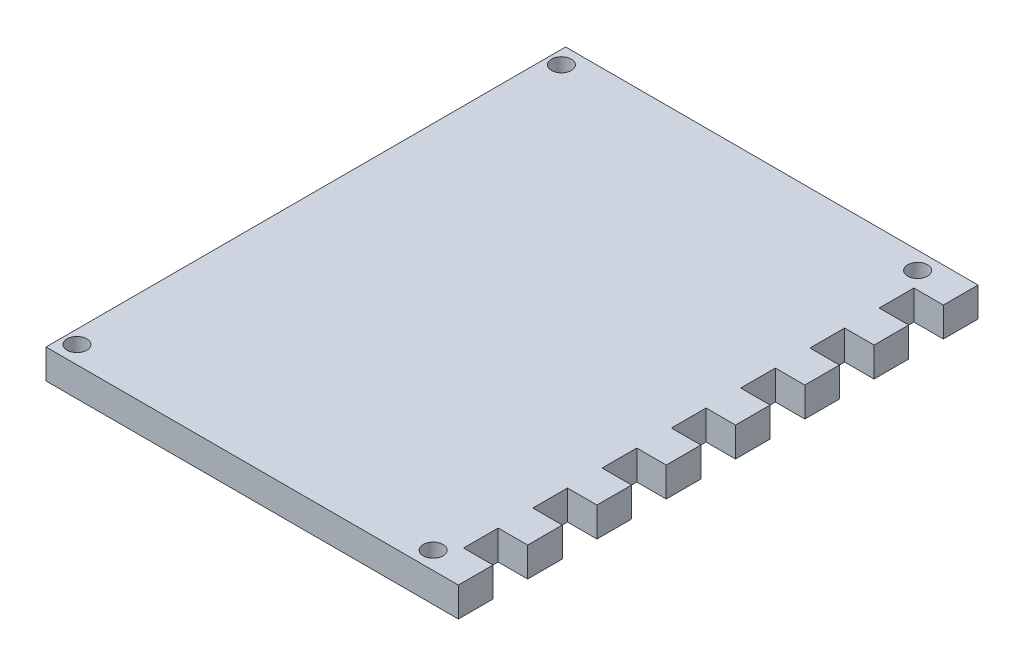
ISO-10303-21;
HEADER;
FILE_DESCRIPTION(('STEP AP214'),'2;1');
FILE_NAME('part.step','',(''),(''),'','','');
FILE_SCHEMA(('AUTOMOTIVE_DESIGN { 1 0 10303 214 1 1 1 1 }'));
ENDSEC;
DATA;
#1=APPLICATION_CONTEXT('core data for automotive mechanical design processes');
#2=APPLICATION_PROTOCOL_DEFINITION('international standard','automotive_design',2000,#1);
#3=PRODUCT_CONTEXT('',#1,'mechanical');
#4=PRODUCT('Part','Part','',(#3));
#5=PRODUCT_RELATED_PRODUCT_CATEGORY('part','',(#4));
#6=PRODUCT_DEFINITION_FORMATION('','',#4);
#7=PRODUCT_DEFINITION_CONTEXT('part definition',#1,'design');
#8=PRODUCT_DEFINITION('design','',#6,#7);
#9=PRODUCT_DEFINITION_SHAPE('','',#8);
#10=(LENGTH_UNIT() NAMED_UNIT(*) SI_UNIT(.MILLI.,.METRE.));
#11=(NAMED_UNIT(*) PLANE_ANGLE_UNIT() SI_UNIT($,.RADIAN.));
#12=(NAMED_UNIT(*) SI_UNIT($,.STERADIAN.) SOLID_ANGLE_UNIT());
#13=UNCERTAINTY_MEASURE_WITH_UNIT(LENGTH_MEASURE(1.E-05),#10,'distance_accuracy_value','');
#14=(GEOMETRIC_REPRESENTATION_CONTEXT(3) GLOBAL_UNCERTAINTY_ASSIGNED_CONTEXT((#13)) GLOBAL_UNIT_ASSIGNED_CONTEXT((#10,
#11,#12)) REPRESENTATION_CONTEXT('',''));
#15=CARTESIAN_POINT('',(0.,0.,0.));
#16=DIRECTION('',(0.,0.,1.));
#17=DIRECTION('',(1.,0.,0.));
#18=AXIS2_PLACEMENT_3D('',#15,#16,#17);
#19=CARTESIAN_POINT('',(0.,4.7625,0.));
#20=DIRECTION('',(0.,-1.,0.));
#21=DIRECTION('',(0.,0.,-1.));
#22=AXIS2_PLACEMENT_3D('',#19,#20,#21);
#23=PLANE('',#22);
#24=DIRECTION('',(0.,0.,1.));
#25=VECTOR('',#24,1.);
#26=CARTESIAN_POINT('',(0.,4.7625,0.));
#27=LINE('',#26,#25);
#28=CARTESIAN_POINT('',(0.,4.7625,-84.));
#29=VERTEX_POINT('',#28);
#30=CARTESIAN_POINT('',(0.,4.7625,0.));
#31=VERTEX_POINT('',#30);
#32=EDGE_CURVE('E382',#29,#31,#27,.T.);
#33=ORIENTED_EDGE('',*,*,#32,.T.);
#34=DIRECTION('',(1.,0.,0.));
#35=VECTOR('',#34,1.);
#36=CARTESIAN_POINT('',(0.,4.7625,0.));
#37=LINE('',#36,#35);
#38=CARTESIAN_POINT('',(66.6625,4.7625,0.));
#39=VERTEX_POINT('',#38);
#40=EDGE_CURVE('E170',#31,#39,#37,.T.);
#41=ORIENTED_EDGE('',*,*,#40,.T.);
#42=DIRECTION('',(0.,0.,-1.));
#43=VECTOR('',#42,1.);
#44=CARTESIAN_POINT('',(66.6625,4.7625,-5.6));
#45=LINE('',#44,#43);
#46=CARTESIAN_POINT('',(66.6625,4.7625,-5.6));
#47=VERTEX_POINT('',#46);
#48=EDGE_CURVE('E499',#39,#47,#45,.T.);
#49=ORIENTED_EDGE('',*,*,#48,.T.);
#50=DIRECTION('',(-1.,0.,0.));
#51=VECTOR('',#50,1.);
#52=CARTESIAN_POINT('',(61.9,4.7625,-5.6));
#53=LINE('',#52,#51);
#54=CARTESIAN_POINT('',(61.9,4.7625,-5.6));
#55=VERTEX_POINT('',#54);
#56=EDGE_CURVE('E517',#47,#55,#53,.T.);
#57=ORIENTED_EDGE('',*,*,#56,.T.);
#58=DIRECTION('',(0.,0.,-1.));
#59=VECTOR('',#58,1.);
#60=CARTESIAN_POINT('',(61.9,4.7625,-11.2));
#61=LINE('',#60,#59);
#62=CARTESIAN_POINT('',(61.9,4.7625,-11.2));
#63=VERTEX_POINT('',#62);
#64=EDGE_CURVE('E513',#55,#63,#61,.T.);
#65=ORIENTED_EDGE('',*,*,#64,.T.);
#66=DIRECTION('',(1.,0.,0.));
#67=VECTOR('',#66,1.);
#68=CARTESIAN_POINT('',(66.6625,4.7625,-11.2));
#69=LINE('',#68,#67);
#70=CARTESIAN_POINT('',(66.6625,4.7625,-11.2));
#71=VERTEX_POINT('',#70);
#72=EDGE_CURVE('E516',#63,#71,#69,.T.);
#73=ORIENTED_EDGE('',*,*,#72,.T.);
#74=DIRECTION('',(0.,0.,-1.));
#75=VECTOR('',#74,1.);
#76=CARTESIAN_POINT('',(66.6625,4.7625,-16.8));
#77=LINE('',#76,#75);
#78=CARTESIAN_POINT('',(66.6625,4.7625,-16.8));
#79=VERTEX_POINT('',#78);
#80=EDGE_CURVE('E521',#71,#79,#77,.T.);
#81=ORIENTED_EDGE('',*,*,#80,.T.);
#82=DIRECTION('',(-1.,0.,0.));
#83=VECTOR('',#82,1.);
#84=CARTESIAN_POINT('',(61.9,4.7625,-16.8));
#85=LINE('',#84,#83);
#86=CARTESIAN_POINT('',(61.9,4.7625,-16.8));
#87=VERTEX_POINT('',#86);
#88=EDGE_CURVE('E528',#79,#87,#85,.T.);
#89=ORIENTED_EDGE('',*,*,#88,.T.);
#90=DIRECTION('',(0.,0.,-1.));
#91=VECTOR('',#90,1.);
#92=CARTESIAN_POINT('',(61.9,4.7625,-22.4));
#93=LINE('',#92,#91);
#94=CARTESIAN_POINT('',(61.9,4.7625,-22.4));
#95=VERTEX_POINT('',#94);
#96=EDGE_CURVE('E531',#87,#95,#93,.T.);
#97=ORIENTED_EDGE('',*,*,#96,.T.);
#98=DIRECTION('',(1.,0.,0.));
#99=VECTOR('',#98,1.);
#100=CARTESIAN_POINT('',(66.6625,4.7625,-22.4));
#101=LINE('',#100,#99);
#102=CARTESIAN_POINT('',(66.6625,4.7625,-22.4));
#103=VERTEX_POINT('',#102);
#104=EDGE_CURVE('E534',#95,#103,#101,.T.);
#105=ORIENTED_EDGE('',*,*,#104,.T.);
#106=DIRECTION('',(0.,0.,-1.));
#107=VECTOR('',#106,1.);
#108=CARTESIAN_POINT('',(66.6625,4.7625,-28.));
#109=LINE('',#108,#107);
#110=CARTESIAN_POINT('',(66.6625,4.7625,-28.));
#111=VERTEX_POINT('',#110);
#112=EDGE_CURVE('E537',#103,#111,#109,.T.);
#113=ORIENTED_EDGE('',*,*,#112,.T.);
#114=DIRECTION('',(-1.,0.,0.));
#115=VECTOR('',#114,1.);
#116=CARTESIAN_POINT('',(61.9,4.7625,-28.));
#117=LINE('',#116,#115);
#118=CARTESIAN_POINT('',(61.9,4.7625,-28.));
#119=VERTEX_POINT('',#118);
#120=EDGE_CURVE('E540',#111,#119,#117,.T.);
#121=ORIENTED_EDGE('',*,*,#120,.T.);
#122=DIRECTION('',(0.,0.,-1.));
#123=VECTOR('',#122,1.);
#124=CARTESIAN_POINT('',(61.9,4.7625,-33.6));
#125=LINE('',#124,#123);
#126=CARTESIAN_POINT('',(61.9,4.7625,-33.6));
#127=VERTEX_POINT('',#126);
#128=EDGE_CURVE('E543',#119,#127,#125,.T.);
#129=ORIENTED_EDGE('',*,*,#128,.T.);
#130=DIRECTION('',(1.,0.,0.));
#131=VECTOR('',#130,1.);
#132=CARTESIAN_POINT('',(66.6625,4.7625,-33.6));
#133=LINE('',#132,#131);
#134=CARTESIAN_POINT('',(66.6625,4.7625,-33.6));
#135=VERTEX_POINT('',#134);
#136=EDGE_CURVE('E546',#127,#135,#133,.T.);
#137=ORIENTED_EDGE('',*,*,#136,.T.);
#138=DIRECTION('',(0.,0.,-1.));
#139=VECTOR('',#138,1.);
#140=CARTESIAN_POINT('',(66.6625,4.7625,-39.2));
#141=LINE('',#140,#139);
#142=CARTESIAN_POINT('',(66.6625,4.7625,-39.2));
#143=VERTEX_POINT('',#142);
#144=EDGE_CURVE('E549',#135,#143,#141,.T.);
#145=ORIENTED_EDGE('',*,*,#144,.T.);
#146=DIRECTION('',(-1.,0.,0.));
#147=VECTOR('',#146,1.);
#148=CARTESIAN_POINT('',(61.9,4.7625,-39.2));
#149=LINE('',#148,#147);
#150=CARTESIAN_POINT('',(61.9,4.7625,-39.2));
#151=VERTEX_POINT('',#150);
#152=EDGE_CURVE('E552',#143,#151,#149,.T.);
#153=ORIENTED_EDGE('',*,*,#152,.T.);
#154=DIRECTION('',(0.,0.,-1.));
#155=VECTOR('',#154,1.);
#156=CARTESIAN_POINT('',(61.9,4.7625,-44.8));
#157=LINE('',#156,#155);
#158=CARTESIAN_POINT('',(61.9,4.7625,-44.8));
#159=VERTEX_POINT('',#158);
#160=EDGE_CURVE('E555',#151,#159,#157,.T.);
#161=ORIENTED_EDGE('',*,*,#160,.T.);
#162=DIRECTION('',(1.,0.,0.));
#163=VECTOR('',#162,1.);
#164=CARTESIAN_POINT('',(66.6625,4.7625,-44.8));
#165=LINE('',#164,#163);
#166=CARTESIAN_POINT('',(66.6625,4.7625,-44.8));
#167=VERTEX_POINT('',#166);
#168=EDGE_CURVE('E558',#159,#167,#165,.T.);
#169=ORIENTED_EDGE('',*,*,#168,.T.);
#170=DIRECTION('',(0.,0.,-1.));
#171=VECTOR('',#170,1.);
#172=CARTESIAN_POINT('',(66.6625,4.7625,-50.4));
#173=LINE('',#172,#171);
#174=CARTESIAN_POINT('',(66.6625,4.7625,-50.4));
#175=VERTEX_POINT('',#174);
#176=EDGE_CURVE('E561',#167,#175,#173,.T.);
#177=ORIENTED_EDGE('',*,*,#176,.T.);
#178=DIRECTION('',(-1.,0.,0.));
#179=VECTOR('',#178,1.);
#180=CARTESIAN_POINT('',(61.9,4.7625,-50.4));
#181=LINE('',#180,#179);
#182=CARTESIAN_POINT('',(61.9,4.7625,-50.4));
#183=VERTEX_POINT('',#182);
#184=EDGE_CURVE('E564',#175,#183,#181,.T.);
#185=ORIENTED_EDGE('',*,*,#184,.T.);
#186=DIRECTION('',(0.,0.,-1.));
#187=VECTOR('',#186,1.);
#188=CARTESIAN_POINT('',(61.9,4.7625,-56.));
#189=LINE('',#188,#187);
#190=CARTESIAN_POINT('',(61.9,4.7625,-56.));
#191=VERTEX_POINT('',#190);
#192=EDGE_CURVE('E567',#183,#191,#189,.T.);
#193=ORIENTED_EDGE('',*,*,#192,.T.);
#194=DIRECTION('',(1.,0.,0.));
#195=VECTOR('',#194,1.);
#196=CARTESIAN_POINT('',(66.6625,4.7625,-56.));
#197=LINE('',#196,#195);
#198=CARTESIAN_POINT('',(66.6625,4.7625,-56.));
#199=VERTEX_POINT('',#198);
#200=EDGE_CURVE('E570',#191,#199,#197,.T.);
#201=ORIENTED_EDGE('',*,*,#200,.T.);
#202=DIRECTION('',(0.,0.,-1.));
#203=VECTOR('',#202,1.);
#204=CARTESIAN_POINT('',(66.6625,4.7625,-61.6));
#205=LINE('',#204,#203);
#206=CARTESIAN_POINT('',(66.6625,4.7625,-61.6));
#207=VERTEX_POINT('',#206);
#208=EDGE_CURVE('E573',#199,#207,#205,.T.);
#209=ORIENTED_EDGE('',*,*,#208,.T.);
#210=DIRECTION('',(-1.,0.,0.));
#211=VECTOR('',#210,1.);
#212=CARTESIAN_POINT('',(61.9,4.7625,-61.6));
#213=LINE('',#212,#211);
#214=CARTESIAN_POINT('',(61.9,4.7625,-61.6));
#215=VERTEX_POINT('',#214);
#216=EDGE_CURVE('E576',#207,#215,#213,.T.);
#217=ORIENTED_EDGE('',*,*,#216,.T.);
#218=DIRECTION('',(0.,0.,-1.));
#219=VECTOR('',#218,1.);
#220=CARTESIAN_POINT('',(61.9,4.7625,-67.2));
#221=LINE('',#220,#219);
#222=CARTESIAN_POINT('',(61.9,4.7625,-67.2));
#223=VERTEX_POINT('',#222);
#224=EDGE_CURVE('E579',#215,#223,#221,.T.);
#225=ORIENTED_EDGE('',*,*,#224,.T.);
#226=DIRECTION('',(1.,0.,0.));
#227=VECTOR('',#226,1.);
#228=CARTESIAN_POINT('',(66.6625,4.7625,-67.1999999999999));
#229=LINE('',#228,#227);
#230=CARTESIAN_POINT('',(66.6625,4.7625,-67.1999999999999));
#231=VERTEX_POINT('',#230);
#232=EDGE_CURVE('E582',#223,#231,#229,.T.);
#233=ORIENTED_EDGE('',*,*,#232,.T.);
#234=DIRECTION('',(0.,0.,-1.));
#235=VECTOR('',#234,1.);
#236=CARTESIAN_POINT('',(66.6625,4.7625,-72.7999999999999));
#237=LINE('',#236,#235);
#238=CARTESIAN_POINT('',(66.6625,4.7625,-72.7999999999999));
#239=VERTEX_POINT('',#238);
#240=EDGE_CURVE('E585',#231,#239,#237,.T.);
#241=ORIENTED_EDGE('',*,*,#240,.T.);
#242=DIRECTION('',(-1.,0.,0.));
#243=VECTOR('',#242,1.);
#244=CARTESIAN_POINT('',(61.9,4.7625,-72.8));
#245=LINE('',#244,#243);
#246=CARTESIAN_POINT('',(61.9,4.7625,-72.8));
#247=VERTEX_POINT('',#246);
#248=EDGE_CURVE('E588',#239,#247,#245,.T.);
#249=ORIENTED_EDGE('',*,*,#248,.T.);
#250=DIRECTION('',(0.,0.,-1.));
#251=VECTOR('',#250,1.);
#252=CARTESIAN_POINT('',(61.9,4.7625,-78.4));
#253=LINE('',#252,#251);
#254=CARTESIAN_POINT('',(61.9,4.7625,-78.4));
#255=VERTEX_POINT('',#254);
#256=EDGE_CURVE('E262',#247,#255,#253,.T.);
#257=ORIENTED_EDGE('',*,*,#256,.T.);
#258=DIRECTION('',(1.,0.,0.));
#259=VECTOR('',#258,1.);
#260=CARTESIAN_POINT('',(66.6625,4.7625,-78.3999999999999));
#261=LINE('',#260,#259);
#262=CARTESIAN_POINT('',(66.6625,4.7625,-78.3999999999999));
#263=VERTEX_POINT('',#262);
#264=EDGE_CURVE('E255',#255,#263,#261,.T.);
#265=ORIENTED_EDGE('',*,*,#264,.T.);
#266=DIRECTION('',(0.,0.,-1.));
#267=VECTOR('',#266,1.);
#268=CARTESIAN_POINT('',(66.6625,4.7625,-84.));
#269=LINE('',#268,#267);
#270=CARTESIAN_POINT('',(66.6625,4.7625,-84.));
#271=VERTEX_POINT('',#270);
#272=EDGE_CURVE('E259',#263,#271,#269,.T.);
#273=ORIENTED_EDGE('',*,*,#272,.T.);
#274=DIRECTION('',(-1.,0.,0.));
#275=VECTOR('',#274,1.);
#276=CARTESIAN_POINT('',(61.9,4.7625,-84.));
#277=LINE('',#276,#275);
#278=EDGE_CURVE('E57',#271,#29,#277,.T.);
#279=ORIENTED_EDGE('',*,*,#278,.T.);
#280=EDGE_LOOP('',(#33,#41,#49,#57,#65,#73,#81,#89,#97,#105,#113,#121,#129,#137,#145,#153,#161,
#169,#177,#185,#193,#201,#209,#217,#225,#233,#241,#249,#257,#265,#273,#279));
#281=FACE_BOUND('',#280,.T.);
#282=CARTESIAN_POINT('',(2.16,4.7625,-81.16));
#283=DIRECTION('',(0.,1.,0.));
#284=DIRECTION('',(0.,0.,1.));
#285=AXIS2_PLACEMENT_3D('',#282,#283,#284);
#286=CIRCLE('',#285,1.6);
#287=CARTESIAN_POINT('',(2.16,4.7625,-79.56));
#288=VERTEX_POINT('',#287);
#289=EDGE_CURVE('E291',#288,#288,#286,.T.);
#290=ORIENTED_EDGE('',*,*,#289,.F.);
#291=EDGE_LOOP('',(#290));
#292=FACE_BOUND('',#291,.T.);
#293=CARTESIAN_POINT('',(2.15999999999999,4.7625,-2.84));
#294=DIRECTION('',(0.,1.,0.));
#295=DIRECTION('',(0.,0.,-1.));
#296=AXIS2_PLACEMENT_3D('',#293,#294,#295);
#297=CIRCLE('',#296,1.6);
#298=CARTESIAN_POINT('',(2.15999999999999,4.7625,-4.44));
#299=VERTEX_POINT('',#298);
#300=EDGE_CURVE('E615',#299,#299,#297,.T.);
#301=ORIENTED_EDGE('',*,*,#300,.F.);
#302=EDGE_LOOP('',(#301));
#303=FACE_BOUND('',#302,.T.);
#304=CARTESIAN_POINT('',(59.74,4.7625,-2.84));
#305=DIRECTION('',(0.,1.,0.));
#306=DIRECTION('',(0.,0.,1.));
#307=AXIS2_PLACEMENT_3D('',#304,#305,#306);
#308=CIRCLE('',#307,1.6);
#309=CARTESIAN_POINT('',(59.74,4.7625,-1.24));
#310=VERTEX_POINT('',#309);
#311=EDGE_CURVE('E623',#310,#310,#308,.T.);
#312=ORIENTED_EDGE('',*,*,#311,.F.);
#313=EDGE_LOOP('',(#312));
#314=FACE_BOUND('',#313,.T.);
#315=CARTESIAN_POINT('',(59.74,4.7625,-81.16));
#316=DIRECTION('',(0.,1.,0.));
#317=DIRECTION('',(0.,0.,-1.));
#318=AXIS2_PLACEMENT_3D('',#315,#316,#317);
#319=CIRCLE('',#318,1.60000000000001);
#320=CARTESIAN_POINT('',(59.74,4.7625,-82.76));
#321=VERTEX_POINT('',#320);
#322=EDGE_CURVE('E631',#321,#321,#319,.T.);
#323=ORIENTED_EDGE('',*,*,#322,.F.);
#324=EDGE_LOOP('',(#323));
#325=FACE_BOUND('',#324,.T.);
#326=ADVANCED_FACE('F39',(#281,#292,#303,#314,#325),#23,.F.);
#327=CARTESIAN_POINT('',(0.,0.,0.));
#328=DIRECTION('',(0.,-1.,0.));
#329=DIRECTION('',(0.,0.,-1.));
#330=AXIS2_PLACEMENT_3D('',#327,#328,#329);
#331=PLANE('',#330);
#332=CARTESIAN_POINT('',(59.74,0.,-2.84));
#333=DIRECTION('',(0.,1.,0.));
#334=DIRECTION('',(0.,0.,1.));
#335=AXIS2_PLACEMENT_3D('',#332,#333,#334);
#336=CIRCLE('',#335,1.6);
#337=CARTESIAN_POINT('',(59.74,0.,-1.24));
#338=VERTEX_POINT('',#337);
#339=EDGE_CURVE('E627',#338,#338,#336,.T.);
#340=ORIENTED_EDGE('',*,*,#339,.T.);
#341=EDGE_LOOP('',(#340));
#342=FACE_BOUND('',#341,.T.);
#343=CARTESIAN_POINT('',(2.16,0.,-81.16));
#344=DIRECTION('',(0.,1.,0.));
#345=DIRECTION('',(0.,0.,1.));
#346=AXIS2_PLACEMENT_3D('',#343,#344,#345);
#347=CIRCLE('',#346,1.6);
#348=CARTESIAN_POINT('',(2.16,0.,-79.56));
#349=VERTEX_POINT('',#348);
#350=EDGE_CURVE('E610',#349,#349,#347,.T.);
#351=ORIENTED_EDGE('',*,*,#350,.T.);
#352=EDGE_LOOP('',(#351));
#353=FACE_BOUND('',#352,.T.);
#354=DIRECTION('',(0.,0.,1.));
#355=VECTOR('',#354,1.);
#356=CARTESIAN_POINT('',(0.,0.,0.));
#357=LINE('',#356,#355);
#358=CARTESIAN_POINT('',(0.,0.,-84.));
#359=VERTEX_POINT('',#358);
#360=CARTESIAN_POINT('',(0.,0.,0.));
#361=VERTEX_POINT('',#360);
#362=EDGE_CURVE('E286',#359,#361,#357,.T.);
#363=ORIENTED_EDGE('',*,*,#362,.F.);
#364=DIRECTION('',(-1.,0.,0.));
#365=VECTOR('',#364,1.);
#366=CARTESIAN_POINT('',(0.,0.,-84.));
#367=LINE('',#366,#365);
#368=CARTESIAN_POINT('',(66.6625,0.,-84.));
#369=VERTEX_POINT('',#368);
#370=EDGE_CURVE('E158',#369,#359,#367,.T.);
#371=ORIENTED_EDGE('',*,*,#370,.F.);
#372=DIRECTION('',(0.,0.,-1.));
#373=VECTOR('',#372,1.);
#374=CARTESIAN_POINT('',(66.6625,0.,-84.));
#375=LINE('',#374,#373);
#376=CARTESIAN_POINT('',(66.6625,0.,-78.3999999999999));
#377=VERTEX_POINT('',#376);
#378=EDGE_CURVE('E377',#377,#369,#375,.T.);
#379=ORIENTED_EDGE('',*,*,#378,.F.);
#380=DIRECTION('',(1.,0.,0.));
#381=VECTOR('',#380,1.);
#382=CARTESIAN_POINT('',(66.6625,0.,-78.3999999999999));
#383=LINE('',#382,#381);
#384=CARTESIAN_POINT('',(61.9,0.,-78.4));
#385=VERTEX_POINT('',#384);
#386=EDGE_CURVE('E272',#385,#377,#383,.T.);
#387=ORIENTED_EDGE('',*,*,#386,.F.);
#388=DIRECTION('',(0.,0.,-1.));
#389=VECTOR('',#388,1.);
#390=CARTESIAN_POINT('',(61.9,0.,-78.4));
#391=LINE('',#390,#389);
#392=CARTESIAN_POINT('',(61.9,0.,-72.8));
#393=VERTEX_POINT('',#392);
#394=EDGE_CURVE('E372',#393,#385,#391,.T.);
#395=ORIENTED_EDGE('',*,*,#394,.F.);
#396=DIRECTION('',(-1.,0.,0.));
#397=VECTOR('',#396,1.);
#398=CARTESIAN_POINT('',(61.9,0.,-72.8));
#399=LINE('',#398,#397);
#400=CARTESIAN_POINT('',(66.6625,0.,-72.7999999999999));
#401=VERTEX_POINT('',#400);
#402=EDGE_CURVE('E369',#401,#393,#399,.T.);
#403=ORIENTED_EDGE('',*,*,#402,.F.);
#404=DIRECTION('',(0.,0.,-1.));
#405=VECTOR('',#404,1.);
#406=CARTESIAN_POINT('',(66.6625,0.,-72.7999999999999));
#407=LINE('',#406,#405);
#408=CARTESIAN_POINT('',(66.6625,0.,-67.1999999999999));
#409=VERTEX_POINT('',#408);
#410=EDGE_CURVE('E366',#409,#401,#407,.T.);
#411=ORIENTED_EDGE('',*,*,#410,.F.);
#412=DIRECTION('',(1.,0.,0.));
#413=VECTOR('',#412,1.);
#414=CARTESIAN_POINT('',(66.6625,0.,-67.1999999999999));
#415=LINE('',#414,#413);
#416=CARTESIAN_POINT('',(61.9,0.,-67.2));
#417=VERTEX_POINT('',#416);
#418=EDGE_CURVE('E363',#417,#409,#415,.T.);
#419=ORIENTED_EDGE('',*,*,#418,.F.);
#420=DIRECTION('',(0.,0.,-1.));
#421=VECTOR('',#420,1.);
#422=CARTESIAN_POINT('',(61.9,0.,-67.2));
#423=LINE('',#422,#421);
#424=CARTESIAN_POINT('',(61.9,0.,-61.6));
#425=VERTEX_POINT('',#424);
#426=EDGE_CURVE('E360',#425,#417,#423,.T.);
#427=ORIENTED_EDGE('',*,*,#426,.F.);
#428=DIRECTION('',(-1.,0.,0.));
#429=VECTOR('',#428,1.);
#430=CARTESIAN_POINT('',(61.9,0.,-61.6));
#431=LINE('',#430,#429);
#432=CARTESIAN_POINT('',(66.6625,0.,-61.6));
#433=VERTEX_POINT('',#432);
#434=EDGE_CURVE('E357',#433,#425,#431,.T.);
#435=ORIENTED_EDGE('',*,*,#434,.F.);
#436=DIRECTION('',(0.,0.,-1.));
#437=VECTOR('',#436,1.);
#438=CARTESIAN_POINT('',(66.6625,0.,-61.6));
#439=LINE('',#438,#437);
#440=CARTESIAN_POINT('',(66.6625,0.,-56.));
#441=VERTEX_POINT('',#440);
#442=EDGE_CURVE('E354',#441,#433,#439,.T.);
#443=ORIENTED_EDGE('',*,*,#442,.F.);
#444=DIRECTION('',(1.,0.,0.));
#445=VECTOR('',#444,1.);
#446=CARTESIAN_POINT('',(66.6625,0.,-56.));
#447=LINE('',#446,#445);
#448=CARTESIAN_POINT('',(61.9,0.,-56.));
#449=VERTEX_POINT('',#448);
#450=EDGE_CURVE('E351',#449,#441,#447,.T.);
#451=ORIENTED_EDGE('',*,*,#450,.F.);
#452=DIRECTION('',(0.,0.,-1.));
#453=VECTOR('',#452,1.);
#454=CARTESIAN_POINT('',(61.9,0.,-56.));
#455=LINE('',#454,#453);
#456=CARTESIAN_POINT('',(61.9,0.,-50.4));
#457=VERTEX_POINT('',#456);
#458=EDGE_CURVE('E348',#457,#449,#455,.T.);
#459=ORIENTED_EDGE('',*,*,#458,.F.);
#460=DIRECTION('',(-1.,0.,0.));
#461=VECTOR('',#460,1.);
#462=CARTESIAN_POINT('',(61.9,0.,-50.4));
#463=LINE('',#462,#461);
#464=CARTESIAN_POINT('',(66.6625,0.,-50.4));
#465=VERTEX_POINT('',#464);
#466=EDGE_CURVE('E345',#465,#457,#463,.T.);
#467=ORIENTED_EDGE('',*,*,#466,.F.);
#468=DIRECTION('',(0.,0.,-1.));
#469=VECTOR('',#468,1.);
#470=CARTESIAN_POINT('',(66.6625,0.,-50.4));
#471=LINE('',#470,#469);
#472=CARTESIAN_POINT('',(66.6625,0.,-44.8));
#473=VERTEX_POINT('',#472);
#474=EDGE_CURVE('E342',#473,#465,#471,.T.);
#475=ORIENTED_EDGE('',*,*,#474,.F.);
#476=DIRECTION('',(1.,0.,0.));
#477=VECTOR('',#476,1.);
#478=CARTESIAN_POINT('',(66.6625,0.,-44.8));
#479=LINE('',#478,#477);
#480=CARTESIAN_POINT('',(61.9,0.,-44.8));
#481=VERTEX_POINT('',#480);
#482=EDGE_CURVE('E339',#481,#473,#479,.T.);
#483=ORIENTED_EDGE('',*,*,#482,.F.);
#484=DIRECTION('',(0.,0.,-1.));
#485=VECTOR('',#484,1.);
#486=CARTESIAN_POINT('',(61.9,0.,-44.8));
#487=LINE('',#486,#485);
#488=CARTESIAN_POINT('',(61.9,0.,-39.2));
#489=VERTEX_POINT('',#488);
#490=EDGE_CURVE('E336',#489,#481,#487,.T.);
#491=ORIENTED_EDGE('',*,*,#490,.F.);
#492=DIRECTION('',(-1.,0.,0.));
#493=VECTOR('',#492,1.);
#494=CARTESIAN_POINT('',(61.9,0.,-39.2));
#495=LINE('',#494,#493);
#496=CARTESIAN_POINT('',(66.6625,0.,-39.2));
#497=VERTEX_POINT('',#496);
#498=EDGE_CURVE('E333',#497,#489,#495,.T.);
#499=ORIENTED_EDGE('',*,*,#498,.F.);
#500=DIRECTION('',(0.,0.,-1.));
#501=VECTOR('',#500,1.);
#502=CARTESIAN_POINT('',(66.6625,0.,-39.2));
#503=LINE('',#502,#501);
#504=CARTESIAN_POINT('',(66.6625,0.,-33.6));
#505=VERTEX_POINT('',#504);
#506=EDGE_CURVE('E330',#505,#497,#503,.T.);
#507=ORIENTED_EDGE('',*,*,#506,.F.);
#508=DIRECTION('',(1.,0.,0.));
#509=VECTOR('',#508,1.);
#510=CARTESIAN_POINT('',(66.6625,0.,-33.6));
#511=LINE('',#510,#509);
#512=CARTESIAN_POINT('',(61.9,0.,-33.6));
#513=VERTEX_POINT('',#512);
#514=EDGE_CURVE('E327',#513,#505,#511,.T.);
#515=ORIENTED_EDGE('',*,*,#514,.F.);
#516=DIRECTION('',(0.,0.,-1.));
#517=VECTOR('',#516,1.);
#518=CARTESIAN_POINT('',(61.9,0.,-33.6));
#519=LINE('',#518,#517);
#520=CARTESIAN_POINT('',(61.9,0.,-28.));
#521=VERTEX_POINT('',#520);
#522=EDGE_CURVE('E324',#521,#513,#519,.T.);
#523=ORIENTED_EDGE('',*,*,#522,.F.);
#524=DIRECTION('',(-1.,0.,0.));
#525=VECTOR('',#524,1.);
#526=CARTESIAN_POINT('',(61.9,0.,-28.));
#527=LINE('',#526,#525);
#528=CARTESIAN_POINT('',(66.6625,0.,-28.));
#529=VERTEX_POINT('',#528);
#530=EDGE_CURVE('E321',#529,#521,#527,.T.);
#531=ORIENTED_EDGE('',*,*,#530,.F.);
#532=DIRECTION('',(0.,0.,-1.));
#533=VECTOR('',#532,1.);
#534=CARTESIAN_POINT('',(66.6625,0.,-28.));
#535=LINE('',#534,#533);
#536=CARTESIAN_POINT('',(66.6625,0.,-22.4));
#537=VERTEX_POINT('',#536);
#538=EDGE_CURVE('E318',#537,#529,#535,.T.);
#539=ORIENTED_EDGE('',*,*,#538,.F.);
#540=DIRECTION('',(1.,0.,0.));
#541=VECTOR('',#540,1.);
#542=CARTESIAN_POINT('',(66.6625,0.,-22.4));
#543=LINE('',#542,#541);
#544=CARTESIAN_POINT('',(61.9,0.,-22.4));
#545=VERTEX_POINT('',#544);
#546=EDGE_CURVE('E315',#545,#537,#543,.T.);
#547=ORIENTED_EDGE('',*,*,#546,.F.);
#548=DIRECTION('',(0.,0.,-1.));
#549=VECTOR('',#548,1.);
#550=CARTESIAN_POINT('',(61.9,0.,-22.4));
#551=LINE('',#550,#549);
#552=CARTESIAN_POINT('',(61.9,0.,-16.8));
#553=VERTEX_POINT('',#552);
#554=EDGE_CURVE('E312',#553,#545,#551,.T.);
#555=ORIENTED_EDGE('',*,*,#554,.F.);
#556=DIRECTION('',(-1.,0.,0.));
#557=VECTOR('',#556,1.);
#558=CARTESIAN_POINT('',(61.9,0.,-16.8));
#559=LINE('',#558,#557);
#560=CARTESIAN_POINT('',(66.6625,0.,-16.8));
#561=VERTEX_POINT('',#560);
#562=EDGE_CURVE('E309',#561,#553,#559,.T.);
#563=ORIENTED_EDGE('',*,*,#562,.F.);
#564=DIRECTION('',(0.,0.,-1.));
#565=VECTOR('',#564,1.);
#566=CARTESIAN_POINT('',(66.6625,0.,-16.8));
#567=LINE('',#566,#565);
#568=CARTESIAN_POINT('',(66.6625,0.,-11.2));
#569=VERTEX_POINT('',#568);
#570=EDGE_CURVE('E306',#569,#561,#567,.T.);
#571=ORIENTED_EDGE('',*,*,#570,.F.);
#572=DIRECTION('',(1.,0.,0.));
#573=VECTOR('',#572,1.);
#574=CARTESIAN_POINT('',(66.6625,0.,-11.2));
#575=LINE('',#574,#573);
#576=CARTESIAN_POINT('',(61.9,0.,-11.2));
#577=VERTEX_POINT('',#576);
#578=EDGE_CURVE('E303',#577,#569,#575,.T.);
#579=ORIENTED_EDGE('',*,*,#578,.F.);
#580=DIRECTION('',(0.,0.,-1.));
#581=VECTOR('',#580,1.);
#582=CARTESIAN_POINT('',(61.9,0.,-11.2));
#583=LINE('',#582,#581);
#584=CARTESIAN_POINT('',(61.9,0.,-5.6));
#585=VERTEX_POINT('',#584);
#586=EDGE_CURVE('E300',#585,#577,#583,.T.);
#587=ORIENTED_EDGE('',*,*,#586,.F.);
#588=DIRECTION('',(-1.,0.,0.));
#589=VECTOR('',#588,1.);
#590=CARTESIAN_POINT('',(61.9,0.,-5.6));
#591=LINE('',#590,#589);
#592=CARTESIAN_POINT('',(66.6625,0.,-5.6));
#593=VERTEX_POINT('',#592);
#594=EDGE_CURVE('E297',#593,#585,#591,.T.);
#595=ORIENTED_EDGE('',*,*,#594,.F.);
#596=DIRECTION('',(0.,0.,-1.));
#597=VECTOR('',#596,1.);
#598=CARTESIAN_POINT('',(66.6625,0.,-5.6));
#599=LINE('',#598,#597);
#600=CARTESIAN_POINT('',(66.6625,0.,0.));
#601=VERTEX_POINT('',#600);
#602=EDGE_CURVE('E294',#601,#593,#599,.T.);
#603=ORIENTED_EDGE('',*,*,#602,.F.);
#604=DIRECTION('',(1.,0.,0.));
#605=VECTOR('',#604,1.);
#606=CARTESIAN_POINT('',(66.6625,0.,0.));
#607=LINE('',#606,#605);
#608=EDGE_CURVE('E290',#361,#601,#607,.T.);
#609=ORIENTED_EDGE('',*,*,#608,.F.);
#610=EDGE_LOOP('',(#363,#371,#379,#387,#395,#403,#411,#419,#427,#435,#443,#451,#459,#467,#475,
#483,#491,#499,#507,#515,#523,#531,#539,#547,#555,#563,#571,#579,#587,#595,#603,#609));
#611=FACE_BOUND('',#610,.T.);
#612=CARTESIAN_POINT('',(2.15999999999999,0.,-2.84));
#613=DIRECTION('',(0.,1.,0.));
#614=DIRECTION('',(0.,0.,-1.));
#615=AXIS2_PLACEMENT_3D('',#612,#613,#614);
#616=CIRCLE('',#615,1.6);
#617=CARTESIAN_POINT('',(2.15999999999999,0.,-4.44));
#618=VERTEX_POINT('',#617);
#619=EDGE_CURVE('E619',#618,#618,#616,.T.);
#620=ORIENTED_EDGE('',*,*,#619,.T.);
#621=EDGE_LOOP('',(#620));
#622=FACE_BOUND('',#621,.T.);
#623=CARTESIAN_POINT('',(59.74,0.,-81.16));
#624=DIRECTION('',(0.,1.,0.));
#625=DIRECTION('',(0.,0.,-1.));
#626=AXIS2_PLACEMENT_3D('',#623,#624,#625);
#627=CIRCLE('',#626,1.60000000000001);
#628=CARTESIAN_POINT('',(59.74,0.,-82.76));
#629=VERTEX_POINT('',#628);
#630=EDGE_CURVE('E635',#629,#629,#627,.T.);
#631=ORIENTED_EDGE('',*,*,#630,.T.);
#632=EDGE_LOOP('',(#631));
#633=FACE_BOUND('',#632,.T.);
#634=ADVANCED_FACE('F501',(#342,#353,#611,#622,#633),#331,.T.);
#635=CARTESIAN_POINT('',(0.,4.7625,0.));
#636=DIRECTION('',(1.,0.,0.));
#637=DIRECTION('',(0.,0.,-1.));
#638=AXIS2_PLACEMENT_3D('',#635,#636,#637);
#639=PLANE('',#638);
#640=ORIENTED_EDGE('',*,*,#362,.T.);
#641=DIRECTION('',(0.,-1.,0.));
#642=VECTOR('',#641,1.);
#643=CARTESIAN_POINT('',(0.,4.7625,0.));
#644=LINE('',#643,#642);
#645=EDGE_CURVE('E11',#31,#361,#644,.T.);
#646=ORIENTED_EDGE('',*,*,#645,.F.);
#647=ORIENTED_EDGE('',*,*,#32,.F.);
#648=DIRECTION('',(0.,-1.,0.));
#649=VECTOR('',#648,1.);
#650=CARTESIAN_POINT('',(0.,4.7625,-84.));
#651=LINE('',#650,#649);
#652=EDGE_CURVE('E282',#29,#359,#651,.T.);
#653=ORIENTED_EDGE('',*,*,#652,.T.);
#654=EDGE_LOOP('',(#640,#646,#647,#653));
#655=FACE_BOUND('',#654,.T.);
#656=ADVANCED_FACE('F41',(#655),#639,.F.);
#657=CARTESIAN_POINT('',(66.6625,4.7625,0.));
#658=DIRECTION('',(0.,0.,-1.));
#659=DIRECTION('',(-1.,0.,0.));
#660=AXIS2_PLACEMENT_3D('',#657,#658,#659);
#661=PLANE('',#660);
#662=ORIENTED_EDGE('',*,*,#608,.T.);
#663=DIRECTION('',(0.,-1.,0.));
#664=VECTOR('',#663,1.);
#665=CARTESIAN_POINT('',(66.6625,4.7625,0.));
#666=LINE('',#665,#664);
#667=EDGE_CURVE('E49',#39,#601,#666,.T.);
#668=ORIENTED_EDGE('',*,*,#667,.F.);
#669=ORIENTED_EDGE('',*,*,#40,.F.);
#670=ORIENTED_EDGE('',*,*,#645,.T.);
#671=EDGE_LOOP('',(#662,#668,#669,#670));
#672=FACE_BOUND('',#671,.T.);
#673=ADVANCED_FACE('F760',(#672),#661,.F.);
#674=CARTESIAN_POINT('',(66.6625,4.7625,-5.6));
#675=DIRECTION('',(-1.,0.,0.));
#676=DIRECTION('',(0.,0.,1.));
#677=AXIS2_PLACEMENT_3D('',#674,#675,#676);
#678=PLANE('',#677);
#679=ORIENTED_EDGE('',*,*,#602,.T.);
#680=DIRECTION('',(0.,-1.,0.));
#681=VECTOR('',#680,1.);
#682=CARTESIAN_POINT('',(66.6625,4.7625,-5.6));
#683=LINE('',#682,#681);
#684=EDGE_CURVE('E489',#47,#593,#683,.T.);
#685=ORIENTED_EDGE('',*,*,#684,.F.);
#686=ORIENTED_EDGE('',*,*,#48,.F.);
#687=ORIENTED_EDGE('',*,*,#667,.T.);
#688=EDGE_LOOP('',(#679,#685,#686,#687));
#689=FACE_BOUND('',#688,.T.);
#690=ADVANCED_FACE('F497',(#689),#678,.F.);
#691=CARTESIAN_POINT('',(61.9,4.7625,-5.6));
#692=DIRECTION('',(0.,0.,1.));
#693=DIRECTION('',(1.,0.,0.));
#694=AXIS2_PLACEMENT_3D('',#691,#692,#693);
#695=PLANE('',#694);
#696=ORIENTED_EDGE('',*,*,#594,.T.);
#697=DIRECTION('',(0.,-1.,0.));
#698=VECTOR('',#697,1.);
#699=CARTESIAN_POINT('',(61.9,4.7625,-5.6));
#700=LINE('',#699,#698);
#701=EDGE_CURVE('E485',#55,#585,#700,.T.);
#702=ORIENTED_EDGE('',*,*,#701,.F.);
#703=ORIENTED_EDGE('',*,*,#56,.F.);
#704=ORIENTED_EDGE('',*,*,#684,.T.);
#705=EDGE_LOOP('',(#696,#702,#703,#704));
#706=FACE_BOUND('',#705,.T.);
#707=ADVANCED_FACE('F507',(#706),#695,.F.);
#708=CARTESIAN_POINT('',(61.9,4.7625,-11.2));
#709=DIRECTION('',(-1.,0.,0.));
#710=DIRECTION('',(0.,0.,1.));
#711=AXIS2_PLACEMENT_3D('',#708,#709,#710);
#712=PLANE('',#711);
#713=ORIENTED_EDGE('',*,*,#586,.T.);
#714=DIRECTION('',(0.,-1.,0.));
#715=VECTOR('',#714,1.);
#716=CARTESIAN_POINT('',(61.9,4.7625,-11.2));
#717=LINE('',#716,#715);
#718=EDGE_CURVE('E481',#63,#577,#717,.T.);
#719=ORIENTED_EDGE('',*,*,#718,.F.);
#720=ORIENTED_EDGE('',*,*,#64,.F.);
#721=ORIENTED_EDGE('',*,*,#701,.T.);
#722=EDGE_LOOP('',(#713,#719,#720,#721));
#723=FACE_BOUND('',#722,.T.);
#724=ADVANCED_FACE('F511',(#723),#712,.F.);
#725=CARTESIAN_POINT('',(66.6625,4.7625,-11.2));
#726=DIRECTION('',(0.,0.,-1.));
#727=DIRECTION('',(-1.,0.,0.));
#728=AXIS2_PLACEMENT_3D('',#725,#726,#727);
#729=PLANE('',#728);
#730=ORIENTED_EDGE('',*,*,#578,.T.);
#731=DIRECTION('',(0.,-1.,0.));
#732=VECTOR('',#731,1.);
#733=CARTESIAN_POINT('',(66.6625,4.7625,-11.2));
#734=LINE('',#733,#732);
#735=EDGE_CURVE('E477',#71,#569,#734,.T.);
#736=ORIENTED_EDGE('',*,*,#735,.F.);
#737=ORIENTED_EDGE('',*,*,#72,.F.);
#738=ORIENTED_EDGE('',*,*,#718,.T.);
#739=EDGE_LOOP('',(#730,#736,#737,#738));
#740=FACE_BOUND('',#739,.T.);
#741=ADVANCED_FACE('F750',(#740),#729,.F.);
#742=CARTESIAN_POINT('',(66.6625,4.7625,-16.8));
#743=DIRECTION('',(-1.,0.,0.));
#744=DIRECTION('',(0.,0.,1.));
#745=AXIS2_PLACEMENT_3D('',#742,#743,#744);
#746=PLANE('',#745);
#747=ORIENTED_EDGE('',*,*,#570,.T.);
#748=DIRECTION('',(0.,-1.,0.));
#749=VECTOR('',#748,1.);
#750=CARTESIAN_POINT('',(66.6625,4.7625,-16.8));
#751=LINE('',#750,#749);
#752=EDGE_CURVE('E473',#79,#561,#751,.T.);
#753=ORIENTED_EDGE('',*,*,#752,.F.);
#754=ORIENTED_EDGE('',*,*,#80,.F.);
#755=ORIENTED_EDGE('',*,*,#735,.T.);
#756=EDGE_LOOP('',(#747,#753,#754,#755));
#757=FACE_BOUND('',#756,.T.);
#758=ADVANCED_FACE('F746',(#757),#746,.F.);
#759=CARTESIAN_POINT('',(61.9,4.7625,-16.8));
#760=DIRECTION('',(0.,0.,1.));
#761=DIRECTION('',(1.,0.,0.));
#762=AXIS2_PLACEMENT_3D('',#759,#760,#761);
#763=PLANE('',#762);
#764=ORIENTED_EDGE('',*,*,#562,.T.);
#765=DIRECTION('',(0.,-1.,0.));
#766=VECTOR('',#765,1.);
#767=CARTESIAN_POINT('',(61.9,4.7625,-16.8));
#768=LINE('',#767,#766);
#769=EDGE_CURVE('E469',#87,#553,#768,.T.);
#770=ORIENTED_EDGE('',*,*,#769,.F.);
#771=ORIENTED_EDGE('',*,*,#88,.F.);
#772=ORIENTED_EDGE('',*,*,#752,.T.);
#773=EDGE_LOOP('',(#764,#770,#771,#772));
#774=FACE_BOUND('',#773,.T.);
#775=ADVANCED_FACE('F742',(#774),#763,.F.);
#776=CARTESIAN_POINT('',(61.9,4.7625,-22.4));
#777=DIRECTION('',(-1.,0.,0.));
#778=DIRECTION('',(0.,0.,1.));
#779=AXIS2_PLACEMENT_3D('',#776,#777,#778);
#780=PLANE('',#779);
#781=ORIENTED_EDGE('',*,*,#554,.T.);
#782=DIRECTION('',(0.,-1.,0.));
#783=VECTOR('',#782,1.);
#784=CARTESIAN_POINT('',(61.9,4.7625,-22.4));
#785=LINE('',#784,#783);
#786=EDGE_CURVE('E465',#95,#545,#785,.T.);
#787=ORIENTED_EDGE('',*,*,#786,.F.);
#788=ORIENTED_EDGE('',*,*,#96,.F.);
#789=ORIENTED_EDGE('',*,*,#769,.T.);
#790=EDGE_LOOP('',(#781,#787,#788,#789));
#791=FACE_BOUND('',#790,.T.);
#792=ADVANCED_FACE('F738',(#791),#780,.F.);
#793=CARTESIAN_POINT('',(66.6625,4.7625,-22.4));
#794=DIRECTION('',(0.,0.,-1.));
#795=DIRECTION('',(-1.,0.,0.));
#796=AXIS2_PLACEMENT_3D('',#793,#794,#795);
#797=PLANE('',#796);
#798=ORIENTED_EDGE('',*,*,#546,.T.);
#799=DIRECTION('',(0.,-1.,0.));
#800=VECTOR('',#799,1.);
#801=CARTESIAN_POINT('',(66.6625,4.7625,-22.4));
#802=LINE('',#801,#800);
#803=EDGE_CURVE('E461',#103,#537,#802,.T.);
#804=ORIENTED_EDGE('',*,*,#803,.F.);
#805=ORIENTED_EDGE('',*,*,#104,.F.);
#806=ORIENTED_EDGE('',*,*,#786,.T.);
#807=EDGE_LOOP('',(#798,#804,#805,#806));
#808=FACE_BOUND('',#807,.T.);
#809=ADVANCED_FACE('F734',(#808),#797,.F.);
#810=CARTESIAN_POINT('',(66.6625,4.7625,-28.));
#811=DIRECTION('',(-1.,0.,0.));
#812=DIRECTION('',(0.,0.,1.));
#813=AXIS2_PLACEMENT_3D('',#810,#811,#812);
#814=PLANE('',#813);
#815=ORIENTED_EDGE('',*,*,#538,.T.);
#816=DIRECTION('',(0.,-1.,0.));
#817=VECTOR('',#816,1.);
#818=CARTESIAN_POINT('',(66.6625,4.7625,-28.));
#819=LINE('',#818,#817);
#820=EDGE_CURVE('E457',#111,#529,#819,.T.);
#821=ORIENTED_EDGE('',*,*,#820,.F.);
#822=ORIENTED_EDGE('',*,*,#112,.F.);
#823=ORIENTED_EDGE('',*,*,#803,.T.);
#824=EDGE_LOOP('',(#815,#821,#822,#823));
#825=FACE_BOUND('',#824,.T.);
#826=ADVANCED_FACE('F730',(#825),#814,.F.);
#827=CARTESIAN_POINT('',(61.9,4.7625,-28.));
#828=DIRECTION('',(0.,0.,1.));
#829=DIRECTION('',(1.,0.,0.));
#830=AXIS2_PLACEMENT_3D('',#827,#828,#829);
#831=PLANE('',#830);
#832=ORIENTED_EDGE('',*,*,#530,.T.);
#833=DIRECTION('',(0.,-1.,0.));
#834=VECTOR('',#833,1.);
#835=CARTESIAN_POINT('',(61.9,4.7625,-28.));
#836=LINE('',#835,#834);
#837=EDGE_CURVE('E453',#119,#521,#836,.T.);
#838=ORIENTED_EDGE('',*,*,#837,.F.);
#839=ORIENTED_EDGE('',*,*,#120,.F.);
#840=ORIENTED_EDGE('',*,*,#820,.T.);
#841=EDGE_LOOP('',(#832,#838,#839,#840));
#842=FACE_BOUND('',#841,.T.);
#843=ADVANCED_FACE('F726',(#842),#831,.F.);
#844=CARTESIAN_POINT('',(61.9,4.7625,-33.6));
#845=DIRECTION('',(-1.,0.,0.));
#846=DIRECTION('',(0.,0.,1.));
#847=AXIS2_PLACEMENT_3D('',#844,#845,#846);
#848=PLANE('',#847);
#849=ORIENTED_EDGE('',*,*,#522,.T.);
#850=DIRECTION('',(0.,-1.,0.));
#851=VECTOR('',#850,1.);
#852=CARTESIAN_POINT('',(61.9,4.7625,-33.6));
#853=LINE('',#852,#851);
#854=EDGE_CURVE('E449',#127,#513,#853,.T.);
#855=ORIENTED_EDGE('',*,*,#854,.F.);
#856=ORIENTED_EDGE('',*,*,#128,.F.);
#857=ORIENTED_EDGE('',*,*,#837,.T.);
#858=EDGE_LOOP('',(#849,#855,#856,#857));
#859=FACE_BOUND('',#858,.T.);
#860=ADVANCED_FACE('F722',(#859),#848,.F.);
#861=CARTESIAN_POINT('',(66.6625,4.7625,-33.6));
#862=DIRECTION('',(0.,0.,-1.));
#863=DIRECTION('',(-1.,0.,0.));
#864=AXIS2_PLACEMENT_3D('',#861,#862,#863);
#865=PLANE('',#864);
#866=ORIENTED_EDGE('',*,*,#514,.T.);
#867=DIRECTION('',(0.,-1.,0.));
#868=VECTOR('',#867,1.);
#869=CARTESIAN_POINT('',(66.6625,4.7625,-33.6));
#870=LINE('',#869,#868);
#871=EDGE_CURVE('E445',#135,#505,#870,.T.);
#872=ORIENTED_EDGE('',*,*,#871,.F.);
#873=ORIENTED_EDGE('',*,*,#136,.F.);
#874=ORIENTED_EDGE('',*,*,#854,.T.);
#875=EDGE_LOOP('',(#866,#872,#873,#874));
#876=FACE_BOUND('',#875,.T.);
#877=ADVANCED_FACE('F718',(#876),#865,.F.);
#878=CARTESIAN_POINT('',(66.6625,4.7625,-39.2));
#879=DIRECTION('',(-1.,0.,0.));
#880=DIRECTION('',(0.,0.,1.));
#881=AXIS2_PLACEMENT_3D('',#878,#879,#880);
#882=PLANE('',#881);
#883=ORIENTED_EDGE('',*,*,#506,.T.);
#884=DIRECTION('',(0.,-1.,0.));
#885=VECTOR('',#884,1.);
#886=CARTESIAN_POINT('',(66.6625,4.7625,-39.2));
#887=LINE('',#886,#885);
#888=EDGE_CURVE('E441',#143,#497,#887,.T.);
#889=ORIENTED_EDGE('',*,*,#888,.F.);
#890=ORIENTED_EDGE('',*,*,#144,.F.);
#891=ORIENTED_EDGE('',*,*,#871,.T.);
#892=EDGE_LOOP('',(#883,#889,#890,#891));
#893=FACE_BOUND('',#892,.T.);
#894=ADVANCED_FACE('F714',(#893),#882,.F.);
#895=CARTESIAN_POINT('',(61.9,4.7625,-39.2));
#896=DIRECTION('',(0.,0.,1.));
#897=DIRECTION('',(1.,0.,0.));
#898=AXIS2_PLACEMENT_3D('',#895,#896,#897);
#899=PLANE('',#898);
#900=ORIENTED_EDGE('',*,*,#498,.T.);
#901=DIRECTION('',(0.,-1.,0.));
#902=VECTOR('',#901,1.);
#903=CARTESIAN_POINT('',(61.9,4.7625,-39.2));
#904=LINE('',#903,#902);
#905=EDGE_CURVE('E437',#151,#489,#904,.T.);
#906=ORIENTED_EDGE('',*,*,#905,.F.);
#907=ORIENTED_EDGE('',*,*,#152,.F.);
#908=ORIENTED_EDGE('',*,*,#888,.T.);
#909=EDGE_LOOP('',(#900,#906,#907,#908));
#910=FACE_BOUND('',#909,.T.);
#911=ADVANCED_FACE('F710',(#910),#899,.F.);
#912=CARTESIAN_POINT('',(61.9,4.7625,-44.8));
#913=DIRECTION('',(-1.,0.,0.));
#914=DIRECTION('',(0.,0.,1.));
#915=AXIS2_PLACEMENT_3D('',#912,#913,#914);
#916=PLANE('',#915);
#917=ORIENTED_EDGE('',*,*,#490,.T.);
#918=DIRECTION('',(0.,-1.,0.));
#919=VECTOR('',#918,1.);
#920=CARTESIAN_POINT('',(61.9,4.7625,-44.8));
#921=LINE('',#920,#919);
#922=EDGE_CURVE('E433',#159,#481,#921,.T.);
#923=ORIENTED_EDGE('',*,*,#922,.F.);
#924=ORIENTED_EDGE('',*,*,#160,.F.);
#925=ORIENTED_EDGE('',*,*,#905,.T.);
#926=EDGE_LOOP('',(#917,#923,#924,#925));
#927=FACE_BOUND('',#926,.T.);
#928=ADVANCED_FACE('F706',(#927),#916,.F.);
#929=CARTESIAN_POINT('',(66.6625,4.7625,-44.8));
#930=DIRECTION('',(0.,0.,-1.));
#931=DIRECTION('',(-1.,0.,0.));
#932=AXIS2_PLACEMENT_3D('',#929,#930,#931);
#933=PLANE('',#932);
#934=ORIENTED_EDGE('',*,*,#482,.T.);
#935=DIRECTION('',(0.,-1.,0.));
#936=VECTOR('',#935,1.);
#937=CARTESIAN_POINT('',(66.6625,4.7625,-44.8));
#938=LINE('',#937,#936);
#939=EDGE_CURVE('E429',#167,#473,#938,.T.);
#940=ORIENTED_EDGE('',*,*,#939,.F.);
#941=ORIENTED_EDGE('',*,*,#168,.F.);
#942=ORIENTED_EDGE('',*,*,#922,.T.);
#943=EDGE_LOOP('',(#934,#940,#941,#942));
#944=FACE_BOUND('',#943,.T.);
#945=ADVANCED_FACE('F702',(#944),#933,.F.);
#946=CARTESIAN_POINT('',(66.6625,4.7625,-50.4));
#947=DIRECTION('',(-1.,0.,0.));
#948=DIRECTION('',(0.,0.,1.));
#949=AXIS2_PLACEMENT_3D('',#946,#947,#948);
#950=PLANE('',#949);
#951=ORIENTED_EDGE('',*,*,#474,.T.);
#952=DIRECTION('',(0.,-1.,0.));
#953=VECTOR('',#952,1.);
#954=CARTESIAN_POINT('',(66.6625,4.7625,-50.4));
#955=LINE('',#954,#953);
#956=EDGE_CURVE('E425',#175,#465,#955,.T.);
#957=ORIENTED_EDGE('',*,*,#956,.F.);
#958=ORIENTED_EDGE('',*,*,#176,.F.);
#959=ORIENTED_EDGE('',*,*,#939,.T.);
#960=EDGE_LOOP('',(#951,#957,#958,#959));
#961=FACE_BOUND('',#960,.T.);
#962=ADVANCED_FACE('F698',(#961),#950,.F.);
#963=CARTESIAN_POINT('',(61.9,4.7625,-50.4));
#964=DIRECTION('',(0.,0.,1.));
#965=DIRECTION('',(1.,0.,0.));
#966=AXIS2_PLACEMENT_3D('',#963,#964,#965);
#967=PLANE('',#966);
#968=ORIENTED_EDGE('',*,*,#466,.T.);
#969=DIRECTION('',(0.,-1.,0.));
#970=VECTOR('',#969,1.);
#971=CARTESIAN_POINT('',(61.9,4.7625,-50.4));
#972=LINE('',#971,#970);
#973=EDGE_CURVE('E421',#183,#457,#972,.T.);
#974=ORIENTED_EDGE('',*,*,#973,.F.);
#975=ORIENTED_EDGE('',*,*,#184,.F.);
#976=ORIENTED_EDGE('',*,*,#956,.T.);
#977=EDGE_LOOP('',(#968,#974,#975,#976));
#978=FACE_BOUND('',#977,.T.);
#979=ADVANCED_FACE('F694',(#978),#967,.F.);
#980=CARTESIAN_POINT('',(61.9,4.7625,-56.));
#981=DIRECTION('',(-1.,0.,0.));
#982=DIRECTION('',(0.,0.,1.));
#983=AXIS2_PLACEMENT_3D('',#980,#981,#982);
#984=PLANE('',#983);
#985=ORIENTED_EDGE('',*,*,#458,.T.);
#986=DIRECTION('',(0.,-1.,0.));
#987=VECTOR('',#986,1.);
#988=CARTESIAN_POINT('',(61.9,4.7625,-56.));
#989=LINE('',#988,#987);
#990=EDGE_CURVE('E417',#191,#449,#989,.T.);
#991=ORIENTED_EDGE('',*,*,#990,.F.);
#992=ORIENTED_EDGE('',*,*,#192,.F.);
#993=ORIENTED_EDGE('',*,*,#973,.T.);
#994=EDGE_LOOP('',(#985,#991,#992,#993));
#995=FACE_BOUND('',#994,.T.);
#996=ADVANCED_FACE('F690',(#995),#984,.F.);
#997=CARTESIAN_POINT('',(66.6625,4.7625,-56.));
#998=DIRECTION('',(0.,0.,-1.));
#999=DIRECTION('',(-1.,0.,0.));
#1000=AXIS2_PLACEMENT_3D('',#997,#998,#999);
#1001=PLANE('',#1000);
#1002=ORIENTED_EDGE('',*,*,#450,.T.);
#1003=DIRECTION('',(0.,-1.,0.));
#1004=VECTOR('',#1003,1.);
#1005=CARTESIAN_POINT('',(66.6625,4.7625,-56.));
#1006=LINE('',#1005,#1004);
#1007=EDGE_CURVE('E413',#199,#441,#1006,.T.);
#1008=ORIENTED_EDGE('',*,*,#1007,.F.);
#1009=ORIENTED_EDGE('',*,*,#200,.F.);
#1010=ORIENTED_EDGE('',*,*,#990,.T.);
#1011=EDGE_LOOP('',(#1002,#1008,#1009,#1010));
#1012=FACE_BOUND('',#1011,.T.);
#1013=ADVANCED_FACE('F686',(#1012),#1001,.F.);
#1014=CARTESIAN_POINT('',(66.6625,4.7625,-61.6));
#1015=DIRECTION('',(-1.,0.,0.));
#1016=DIRECTION('',(0.,0.,1.));
#1017=AXIS2_PLACEMENT_3D('',#1014,#1015,#1016);
#1018=PLANE('',#1017);
#1019=ORIENTED_EDGE('',*,*,#442,.T.);
#1020=DIRECTION('',(0.,-1.,0.));
#1021=VECTOR('',#1020,1.);
#1022=CARTESIAN_POINT('',(66.6625,4.7625,-61.6));
#1023=LINE('',#1022,#1021);
#1024=EDGE_CURVE('E409',#207,#433,#1023,.T.);
#1025=ORIENTED_EDGE('',*,*,#1024,.F.);
#1026=ORIENTED_EDGE('',*,*,#208,.F.);
#1027=ORIENTED_EDGE('',*,*,#1007,.T.);
#1028=EDGE_LOOP('',(#1019,#1025,#1026,#1027));
#1029=FACE_BOUND('',#1028,.T.);
#1030=ADVANCED_FACE('F682',(#1029),#1018,.F.);
#1031=CARTESIAN_POINT('',(61.9,4.7625,-61.6));
#1032=DIRECTION('',(0.,0.,1.));
#1033=DIRECTION('',(1.,0.,0.));
#1034=AXIS2_PLACEMENT_3D('',#1031,#1032,#1033);
#1035=PLANE('',#1034);
#1036=ORIENTED_EDGE('',*,*,#434,.T.);
#1037=DIRECTION('',(0.,-1.,0.));
#1038=VECTOR('',#1037,1.);
#1039=CARTESIAN_POINT('',(61.9,4.7625,-61.6));
#1040=LINE('',#1039,#1038);
#1041=EDGE_CURVE('E405',#215,#425,#1040,.T.);
#1042=ORIENTED_EDGE('',*,*,#1041,.F.);
#1043=ORIENTED_EDGE('',*,*,#216,.F.);
#1044=ORIENTED_EDGE('',*,*,#1024,.T.);
#1045=EDGE_LOOP('',(#1036,#1042,#1043,#1044));
#1046=FACE_BOUND('',#1045,.T.);
#1047=ADVANCED_FACE('F678',(#1046),#1035,.F.);
#1048=CARTESIAN_POINT('',(61.9,4.7625,-67.2));
#1049=DIRECTION('',(-1.,0.,0.));
#1050=DIRECTION('',(0.,0.,1.));
#1051=AXIS2_PLACEMENT_3D('',#1048,#1049,#1050);
#1052=PLANE('',#1051);
#1053=ORIENTED_EDGE('',*,*,#426,.T.);
#1054=DIRECTION('',(0.,-1.,0.));
#1055=VECTOR('',#1054,1.);
#1056=CARTESIAN_POINT('',(61.9,4.7625,-67.2));
#1057=LINE('',#1056,#1055);
#1058=EDGE_CURVE('E401',#223,#417,#1057,.T.);
#1059=ORIENTED_EDGE('',*,*,#1058,.F.);
#1060=ORIENTED_EDGE('',*,*,#224,.F.);
#1061=ORIENTED_EDGE('',*,*,#1041,.T.);
#1062=EDGE_LOOP('',(#1053,#1059,#1060,#1061));
#1063=FACE_BOUND('',#1062,.T.);
#1064=ADVANCED_FACE('F674',(#1063),#1052,.F.);
#1065=CARTESIAN_POINT('',(66.6625,4.7625,-67.1999999999999));
#1066=DIRECTION('',(0.,0.,-1.));
#1067=DIRECTION('',(-1.,0.,0.));
#1068=AXIS2_PLACEMENT_3D('',#1065,#1066,#1067);
#1069=PLANE('',#1068);
#1070=ORIENTED_EDGE('',*,*,#418,.T.);
#1071=DIRECTION('',(0.,-1.,0.));
#1072=VECTOR('',#1071,1.);
#1073=CARTESIAN_POINT('',(66.6625,4.7625,-67.1999999999999));
#1074=LINE('',#1073,#1072);
#1075=EDGE_CURVE('E397',#231,#409,#1074,.T.);
#1076=ORIENTED_EDGE('',*,*,#1075,.F.);
#1077=ORIENTED_EDGE('',*,*,#232,.F.);
#1078=ORIENTED_EDGE('',*,*,#1058,.T.);
#1079=EDGE_LOOP('',(#1070,#1076,#1077,#1078));
#1080=FACE_BOUND('',#1079,.T.);
#1081=ADVANCED_FACE('F670',(#1080),#1069,.F.);
#1082=CARTESIAN_POINT('',(66.6625,4.7625,-72.7999999999999));
#1083=DIRECTION('',(-1.,0.,0.));
#1084=DIRECTION('',(0.,0.,1.));
#1085=AXIS2_PLACEMENT_3D('',#1082,#1083,#1084);
#1086=PLANE('',#1085);
#1087=ORIENTED_EDGE('',*,*,#410,.T.);
#1088=DIRECTION('',(0.,-1.,0.));
#1089=VECTOR('',#1088,1.);
#1090=CARTESIAN_POINT('',(66.6625,4.7625,-72.7999999999999));
#1091=LINE('',#1090,#1089);
#1092=EDGE_CURVE('E393',#239,#401,#1091,.T.);
#1093=ORIENTED_EDGE('',*,*,#1092,.F.);
#1094=ORIENTED_EDGE('',*,*,#240,.F.);
#1095=ORIENTED_EDGE('',*,*,#1075,.T.);
#1096=EDGE_LOOP('',(#1087,#1093,#1094,#1095));
#1097=FACE_BOUND('',#1096,.T.);
#1098=ADVANCED_FACE('F667',(#1097),#1086,.F.);
#1099=CARTESIAN_POINT('',(61.9,4.7625,-72.8));
#1100=DIRECTION('',(0.,0.,1.));
#1101=DIRECTION('',(1.,0.,0.));
#1102=AXIS2_PLACEMENT_3D('',#1099,#1100,#1101);
#1103=PLANE('',#1102);
#1104=ORIENTED_EDGE('',*,*,#402,.T.);
#1105=DIRECTION('',(0.,-1.,0.));
#1106=VECTOR('',#1105,1.);
#1107=CARTESIAN_POINT('',(61.9,4.7625,-72.8));
#1108=LINE('',#1107,#1106);
#1109=EDGE_CURVE('E389',#247,#393,#1108,.T.);
#1110=ORIENTED_EDGE('',*,*,#1109,.F.);
#1111=ORIENTED_EDGE('',*,*,#248,.F.);
#1112=ORIENTED_EDGE('',*,*,#1092,.T.);
#1113=EDGE_LOOP('',(#1104,#1110,#1111,#1112));
#1114=FACE_BOUND('',#1113,.T.);
#1115=ADVANCED_FACE('F596',(#1114),#1103,.F.);
#1116=CARTESIAN_POINT('',(61.9,4.7625,-78.4));
#1117=DIRECTION('',(-1.,0.,0.));
#1118=DIRECTION('',(0.,0.,1.));
#1119=AXIS2_PLACEMENT_3D('',#1116,#1117,#1118);
#1120=PLANE('',#1119);
#1121=ORIENTED_EDGE('',*,*,#394,.T.);
#1122=DIRECTION('',(0.,-1.,0.));
#1123=VECTOR('',#1122,1.);
#1124=CARTESIAN_POINT('',(61.9,4.7625,-78.4));
#1125=LINE('',#1124,#1123);
#1126=EDGE_CURVE('E275',#255,#385,#1125,.T.);
#1127=ORIENTED_EDGE('',*,*,#1126,.F.);
#1128=ORIENTED_EDGE('',*,*,#256,.F.);
#1129=ORIENTED_EDGE('',*,*,#1109,.T.);
#1130=EDGE_LOOP('',(#1121,#1127,#1128,#1129));
#1131=FACE_BOUND('',#1130,.T.);
#1132=ADVANCED_FACE('F600',(#1131),#1120,.F.);
#1133=CARTESIAN_POINT('',(66.6625,4.7625,-78.3999999999999));
#1134=DIRECTION('',(0.,0.,-1.));
#1135=DIRECTION('',(-1.,0.,0.));
#1136=AXIS2_PLACEMENT_3D('',#1133,#1134,#1135);
#1137=PLANE('',#1136);
#1138=ORIENTED_EDGE('',*,*,#386,.T.);
#1139=DIRECTION('',(0.,-1.,0.));
#1140=VECTOR('',#1139,1.);
#1141=CARTESIAN_POINT('',(66.6625,4.7625,-78.3999999999999));
#1142=LINE('',#1141,#1140);
#1143=EDGE_CURVE('E269',#263,#377,#1142,.T.);
#1144=ORIENTED_EDGE('',*,*,#1143,.F.);
#1145=ORIENTED_EDGE('',*,*,#264,.F.);
#1146=ORIENTED_EDGE('',*,*,#1126,.T.);
#1147=EDGE_LOOP('',(#1138,#1144,#1145,#1146));
#1148=FACE_BOUND('',#1147,.T.);
#1149=ADVANCED_FACE('F270',(#1148),#1137,.F.);
#1150=CARTESIAN_POINT('',(66.6625,4.7625,-84.));
#1151=DIRECTION('',(-1.,0.,0.));
#1152=DIRECTION('',(0.,0.,1.));
#1153=AXIS2_PLACEMENT_3D('',#1150,#1151,#1152);
#1154=PLANE('',#1153);
#1155=ORIENTED_EDGE('',*,*,#378,.T.);
#1156=DIRECTION('',(0.,-1.,0.));
#1157=VECTOR('',#1156,1.);
#1158=CARTESIAN_POINT('',(66.6625,4.7625,-84.));
#1159=LINE('',#1158,#1157);
#1160=EDGE_CURVE('E276',#271,#369,#1159,.T.);
#1161=ORIENTED_EDGE('',*,*,#1160,.F.);
#1162=ORIENTED_EDGE('',*,*,#272,.F.);
#1163=ORIENTED_EDGE('',*,*,#1143,.T.);
#1164=EDGE_LOOP('',(#1155,#1161,#1162,#1163));
#1165=FACE_BOUND('',#1164,.T.);
#1166=ADVANCED_FACE('F278',(#1165),#1154,.F.);
#1167=CARTESIAN_POINT('',(0.,4.7625,-84.));
#1168=DIRECTION('',(0.,0.,1.));
#1169=DIRECTION('',(1.,0.,0.));
#1170=AXIS2_PLACEMENT_3D('',#1167,#1168,#1169);
#1171=PLANE('',#1170);
#1172=ORIENTED_EDGE('',*,*,#370,.T.);
#1173=ORIENTED_EDGE('',*,*,#652,.F.);
#1174=ORIENTED_EDGE('',*,*,#278,.F.);
#1175=ORIENTED_EDGE('',*,*,#1160,.T.);
#1176=EDGE_LOOP('',(#1172,#1173,#1174,#1175));
#1177=FACE_BOUND('',#1176,.T.);
#1178=ADVANCED_FACE('F601',(#1177),#1171,.F.);
#1179=CARTESIAN_POINT('',(2.16,4.7625,-81.16));
#1180=DIRECTION('',(0.,-1.,0.));
#1181=DIRECTION('',(0.,0.,-1.));
#1182=AXIS2_PLACEMENT_3D('',#1179,#1180,#1181);
#1183=CYLINDRICAL_SURFACE('',#1182,1.6);
#1184=ORIENTED_EDGE('',*,*,#289,.T.);
#1185=EDGE_LOOP('',(#1184));
#1186=FACE_BOUND('',#1185,.T.);
#1187=ORIENTED_EDGE('',*,*,#350,.F.);
#1188=EDGE_LOOP('',(#1187));
#1189=FACE_BOUND('',#1188,.T.);
#1190=ADVANCED_FACE('F654',(#1186,#1189),#1183,.F.);
#1191=CARTESIAN_POINT('',(2.15999999999999,4.7625,-2.84));
#1192=DIRECTION('',(0.,-1.,0.));
#1193=DIRECTION('',(0.,0.,-1.));
#1194=AXIS2_PLACEMENT_3D('',#1191,#1192,#1193);
#1195=CYLINDRICAL_SURFACE('',#1194,1.6);
#1196=ORIENTED_EDGE('',*,*,#300,.T.);
#1197=EDGE_LOOP('',(#1196));
#1198=FACE_BOUND('',#1197,.T.);
#1199=ORIENTED_EDGE('',*,*,#619,.F.);
#1200=EDGE_LOOP('',(#1199));
#1201=FACE_BOUND('',#1200,.T.);
#1202=ADVANCED_FACE('F947',(#1198,#1201),#1195,.F.);
#1203=CARTESIAN_POINT('',(59.74,4.7625,-2.84));
#1204=DIRECTION('',(0.,-1.,0.));
#1205=DIRECTION('',(0.,0.,-1.));
#1206=AXIS2_PLACEMENT_3D('',#1203,#1204,#1205);
#1207=CYLINDRICAL_SURFACE('',#1206,1.6);
#1208=ORIENTED_EDGE('',*,*,#311,.T.);
#1209=EDGE_LOOP('',(#1208));
#1210=FACE_BOUND('',#1209,.T.);
#1211=ORIENTED_EDGE('',*,*,#339,.F.);
#1212=EDGE_LOOP('',(#1211));
#1213=FACE_BOUND('',#1212,.T.);
#1214=ADVANCED_FACE('F955',(#1210,#1213),#1207,.F.);
#1215=CARTESIAN_POINT('',(59.74,4.7625,-81.16));
#1216=DIRECTION('',(0.,-1.,0.));
#1217=DIRECTION('',(0.,0.,-1.));
#1218=AXIS2_PLACEMENT_3D('',#1215,#1216,#1217);
#1219=CYLINDRICAL_SURFACE('',#1218,1.60000000000001);
#1220=ORIENTED_EDGE('',*,*,#322,.T.);
#1221=EDGE_LOOP('',(#1220));
#1222=FACE_BOUND('',#1221,.T.);
#1223=ORIENTED_EDGE('',*,*,#630,.F.);
#1224=EDGE_LOOP('',(#1223));
#1225=FACE_BOUND('',#1224,.T.);
#1226=ADVANCED_FACE('F643',(#1222,#1225),#1219,.F.);
#1227=CLOSED_SHELL('',(#326,#634,#656,#673,#690,#707,#724,#741,#758,#775,#792,#809,#826,#843,
#860,#877,#894,#911,#928,#945,#962,#979,#996,#1013,#1030,#1047,#1064,#1081,#1098,#1115,#1132,
#1149,#1166,#1178,#1190,#1202,#1214,#1226));
#1228=MANIFOLD_SOLID_BREP('B2',#1227);
#1229=ADVANCED_BREP_SHAPE_REPRESENTATION('',(#18,#1228),#14);
#1230=SHAPE_DEFINITION_REPRESENTATION(#9,#1229);
ENDSEC;
END-ISO-10303-21;
